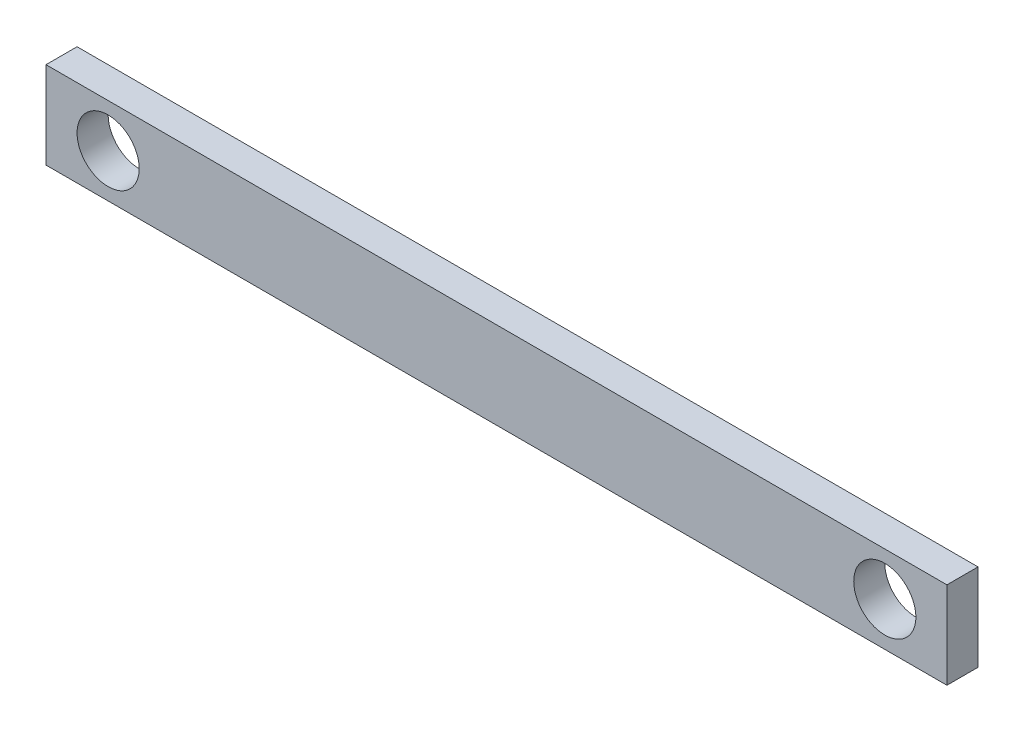
ISO-10303-21;
HEADER;
FILE_DESCRIPTION(('STEP AP214'),'2;1');
FILE_NAME('part.step','',(''),(''),'','','');
FILE_SCHEMA(('AUTOMOTIVE_DESIGN { 1 0 10303 214 1 1 1 1 }'));
ENDSEC;
DATA;
#1=APPLICATION_CONTEXT('core data for automotive mechanical design processes');
#2=APPLICATION_PROTOCOL_DEFINITION('international standard','automotive_design',2000,#1);
#3=PRODUCT_CONTEXT('',#1,'mechanical');
#4=PRODUCT('Part','Part','',(#3));
#5=PRODUCT_RELATED_PRODUCT_CATEGORY('part','',(#4));
#6=PRODUCT_DEFINITION_FORMATION('','',#4);
#7=PRODUCT_DEFINITION_CONTEXT('part definition',#1,'design');
#8=PRODUCT_DEFINITION('design','',#6,#7);
#9=PRODUCT_DEFINITION_SHAPE('','',#8);
#10=(LENGTH_UNIT() NAMED_UNIT(*) SI_UNIT(.MILLI.,.METRE.));
#11=(NAMED_UNIT(*) PLANE_ANGLE_UNIT() SI_UNIT($,.RADIAN.));
#12=(NAMED_UNIT(*) SI_UNIT($,.STERADIAN.) SOLID_ANGLE_UNIT());
#13=UNCERTAINTY_MEASURE_WITH_UNIT(LENGTH_MEASURE(1.E-05),#10,'distance_accuracy_value','');
#14=(GEOMETRIC_REPRESENTATION_CONTEXT(3) GLOBAL_UNCERTAINTY_ASSIGNED_CONTEXT((#13)) GLOBAL_UNIT_ASSIGNED_CONTEXT((#10,
#11,#12)) REPRESENTATION_CONTEXT('',''));
#15=CARTESIAN_POINT('',(0.,0.,0.));
#16=DIRECTION('',(0.,0.,1.));
#17=DIRECTION('',(1.,0.,0.));
#18=AXIS2_PLACEMENT_3D('',#15,#16,#17);
#19=CARTESIAN_POINT('',(0.,0.,-60.));
#20=DIRECTION('',(0.,0.,-1.));
#21=DIRECTION('',(-1.,0.,0.));
#22=AXIS2_PLACEMENT_3D('',#19,#20,#21);
#23=PLANE('',#22);
#24=CARTESIAN_POINT('',(3930.,70.,-60.));
#25=DIRECTION('',(0.,0.,-1.));
#26=DIRECTION('',(-1.,0.,0.));
#27=AXIS2_PLACEMENT_3D('',#24,#25,#26);
#28=CIRCLE('',#27,50.);
#29=CARTESIAN_POINT('',(3880.,70.,-60.));
#30=VERTEX_POINT('',#29);
#31=EDGE_CURVE('E105',#30,#30,#28,.T.);
#32=ORIENTED_EDGE('',*,*,#31,.F.);
#33=EDGE_LOOP('',(#32));
#34=FACE_BOUND('',#33,.T.);
#35=DIRECTION('',(1.,0.,0.));
#36=VECTOR('',#35,1.);
#37=CARTESIAN_POINT('',(2580.,140.,-60.));
#38=LINE('',#37,#36);
#39=CARTESIAN_POINT('',(2580.,140.,-60.));
#40=VERTEX_POINT('',#39);
#41=CARTESIAN_POINT('',(4030.,140.,-60.));
#42=VERTEX_POINT('',#41);
#43=EDGE_CURVE('E90',#40,#42,#38,.T.);
#44=ORIENTED_EDGE('',*,*,#43,.T.);
#45=DIRECTION('',(0.,-1.,0.));
#46=VECTOR('',#45,1.);
#47=CARTESIAN_POINT('',(4030.,140.,-60.));
#48=LINE('',#47,#46);
#49=CARTESIAN_POINT('',(4030.,0.,-60.));
#50=VERTEX_POINT('',#49);
#51=EDGE_CURVE('E85',#42,#50,#48,.T.);
#52=ORIENTED_EDGE('',*,*,#51,.T.);
#53=DIRECTION('',(-1.,0.,0.));
#54=VECTOR('',#53,1.);
#55=CARTESIAN_POINT('',(4030.,0.,-60.));
#56=LINE('',#55,#54);
#57=CARTESIAN_POINT('',(2580.,0.,-60.));
#58=VERTEX_POINT('',#57);
#59=EDGE_CURVE('E88',#50,#58,#56,.T.);
#60=ORIENTED_EDGE('',*,*,#59,.T.);
#61=DIRECTION('',(0.,1.,0.));
#62=VECTOR('',#61,1.);
#63=CARTESIAN_POINT('',(2580.,0.,-60.));
#64=LINE('',#63,#62);
#65=EDGE_CURVE('E55',#58,#40,#64,.T.);
#66=ORIENTED_EDGE('',*,*,#65,.T.);
#67=EDGE_LOOP('',(#44,#52,#60,#66));
#68=FACE_BOUND('',#67,.T.);
#69=CARTESIAN_POINT('',(2680.,70.,-60.));
#70=DIRECTION('',(0.,0.,-1.));
#71=DIRECTION('',(-1.,0.,0.));
#72=AXIS2_PLACEMENT_3D('',#69,#70,#71);
#73=CIRCLE('',#72,50.);
#74=CARTESIAN_POINT('',(2630.,70.,-60.));
#75=VERTEX_POINT('',#74);
#76=EDGE_CURVE('E120',#75,#75,#73,.T.);
#77=ORIENTED_EDGE('',*,*,#76,.F.);
#78=EDGE_LOOP('',(#77));
#79=FACE_BOUND('',#78,.T.);
#80=ADVANCED_FACE('F38',(#34,#68,#79),#23,.T.);
#81=CARTESIAN_POINT('',(0.,0.,-10.));
#82=DIRECTION('',(0.,0.,-1.));
#83=DIRECTION('',(-1.,0.,0.));
#84=AXIS2_PLACEMENT_3D('',#81,#82,#83);
#85=PLANE('',#84);
#86=DIRECTION('',(1.,0.,0.));
#87=VECTOR('',#86,1.);
#88=CARTESIAN_POINT('',(2580.,140.,-10.));
#89=LINE('',#88,#87);
#90=CARTESIAN_POINT('',(2580.,140.,-10.));
#91=VERTEX_POINT('',#90);
#92=CARTESIAN_POINT('',(4030.,140.,-10.));
#93=VERTEX_POINT('',#92);
#94=EDGE_CURVE('E102',#91,#93,#89,.T.);
#95=ORIENTED_EDGE('',*,*,#94,.F.);
#96=DIRECTION('',(0.,1.,0.));
#97=VECTOR('',#96,1.);
#98=CARTESIAN_POINT('',(2580.,0.,-10.));
#99=LINE('',#98,#97);
#100=CARTESIAN_POINT('',(2580.,0.,-10.));
#101=VERTEX_POINT('',#100);
#102=EDGE_CURVE('E78',#101,#91,#99,.T.);
#103=ORIENTED_EDGE('',*,*,#102,.F.);
#104=DIRECTION('',(-1.,0.,0.));
#105=VECTOR('',#104,1.);
#106=CARTESIAN_POINT('',(4030.,0.,-10.));
#107=LINE('',#106,#105);
#108=CARTESIAN_POINT('',(4030.,0.,-10.));
#109=VERTEX_POINT('',#108);
#110=EDGE_CURVE('E72',#109,#101,#107,.T.);
#111=ORIENTED_EDGE('',*,*,#110,.F.);
#112=DIRECTION('',(0.,-1.,0.));
#113=VECTOR('',#112,1.);
#114=CARTESIAN_POINT('',(4030.,140.,-10.));
#115=LINE('',#114,#113);
#116=EDGE_CURVE('E94',#93,#109,#115,.T.);
#117=ORIENTED_EDGE('',*,*,#116,.F.);
#118=EDGE_LOOP('',(#95,#103,#111,#117));
#119=FACE_BOUND('',#118,.T.);
#120=CARTESIAN_POINT('',(3930.,70.,-10.));
#121=DIRECTION('',(0.,0.,-1.));
#122=DIRECTION('',(-1.,0.,0.));
#123=AXIS2_PLACEMENT_3D('',#120,#121,#122);
#124=CIRCLE('',#123,50.);
#125=CARTESIAN_POINT('',(3880.,70.,-10.));
#126=VERTEX_POINT('',#125);
#127=EDGE_CURVE('E117',#126,#126,#124,.T.);
#128=ORIENTED_EDGE('',*,*,#127,.T.);
#129=EDGE_LOOP('',(#128));
#130=FACE_BOUND('',#129,.T.);
#131=CARTESIAN_POINT('',(2680.,70.,-10.));
#132=DIRECTION('',(0.,0.,-1.));
#133=DIRECTION('',(-1.,0.,0.));
#134=AXIS2_PLACEMENT_3D('',#131,#132,#133);
#135=CIRCLE('',#134,50.);
#136=CARTESIAN_POINT('',(2630.,70.,-10.));
#137=VERTEX_POINT('',#136);
#138=EDGE_CURVE('E123',#137,#137,#135,.T.);
#139=ORIENTED_EDGE('',*,*,#138,.T.);
#140=EDGE_LOOP('',(#139));
#141=FACE_BOUND('',#140,.T.);
#142=ADVANCED_FACE('F113',(#119,#130,#141),#85,.F.);
#143=CARTESIAN_POINT('',(2580.,140.,-60.));
#144=DIRECTION('',(0.,-1.,0.));
#145=DIRECTION('',(0.,0.,-1.));
#146=AXIS2_PLACEMENT_3D('',#143,#144,#145);
#147=PLANE('',#146);
#148=ORIENTED_EDGE('',*,*,#94,.T.);
#149=DIRECTION('',(0.,0.,1.));
#150=VECTOR('',#149,1.);
#151=CARTESIAN_POINT('',(4030.,140.,-60.));
#152=LINE('',#151,#150);
#153=EDGE_CURVE('E11',#42,#93,#152,.T.);
#154=ORIENTED_EDGE('',*,*,#153,.F.);
#155=ORIENTED_EDGE('',*,*,#43,.F.);
#156=DIRECTION('',(0.,0.,1.));
#157=VECTOR('',#156,1.);
#158=CARTESIAN_POINT('',(2580.,140.,-60.));
#159=LINE('',#158,#157);
#160=EDGE_CURVE('E98',#40,#91,#159,.T.);
#161=ORIENTED_EDGE('',*,*,#160,.T.);
#162=EDGE_LOOP('',(#148,#154,#155,#161));
#163=FACE_BOUND('',#162,.T.);
#164=ADVANCED_FACE('F40',(#163),#147,.F.);
#165=CARTESIAN_POINT('',(4030.,140.,-60.));
#166=DIRECTION('',(-1.,0.,0.));
#167=DIRECTION('',(0.,0.,1.));
#168=AXIS2_PLACEMENT_3D('',#165,#166,#167);
#169=PLANE('',#168);
#170=ORIENTED_EDGE('',*,*,#116,.T.);
#171=DIRECTION('',(0.,0.,1.));
#172=VECTOR('',#171,1.);
#173=CARTESIAN_POINT('',(4030.,0.,-60.));
#174=LINE('',#173,#172);
#175=EDGE_CURVE('E47',#50,#109,#174,.T.);
#176=ORIENTED_EDGE('',*,*,#175,.F.);
#177=ORIENTED_EDGE('',*,*,#51,.F.);
#178=ORIENTED_EDGE('',*,*,#153,.T.);
#179=EDGE_LOOP('',(#170,#176,#177,#178));
#180=FACE_BOUND('',#179,.T.);
#181=ADVANCED_FACE('F93',(#180),#169,.F.);
#182=CARTESIAN_POINT('',(4030.,0.,-60.));
#183=DIRECTION('',(0.,1.,0.));
#184=DIRECTION('',(0.,0.,1.));
#185=AXIS2_PLACEMENT_3D('',#182,#183,#184);
#186=PLANE('',#185);
#187=ORIENTED_EDGE('',*,*,#110,.T.);
#188=DIRECTION('',(0.,0.,1.));
#189=VECTOR('',#188,1.);
#190=CARTESIAN_POINT('',(2580.,0.,-60.));
#191=LINE('',#190,#189);
#192=EDGE_CURVE('E95',#58,#101,#191,.T.);
#193=ORIENTED_EDGE('',*,*,#192,.F.);
#194=ORIENTED_EDGE('',*,*,#59,.F.);
#195=ORIENTED_EDGE('',*,*,#175,.T.);
#196=EDGE_LOOP('',(#187,#193,#194,#195));
#197=FACE_BOUND('',#196,.T.);
#198=ADVANCED_FACE('F96',(#197),#186,.F.);
#199=CARTESIAN_POINT('',(2580.,0.,-60.));
#200=DIRECTION('',(1.,0.,0.));
#201=DIRECTION('',(0.,0.,-1.));
#202=AXIS2_PLACEMENT_3D('',#199,#200,#201);
#203=PLANE('',#202);
#204=ORIENTED_EDGE('',*,*,#102,.T.);
#205=ORIENTED_EDGE('',*,*,#160,.F.);
#206=ORIENTED_EDGE('',*,*,#65,.F.);
#207=ORIENTED_EDGE('',*,*,#192,.T.);
#208=EDGE_LOOP('',(#204,#205,#206,#207));
#209=FACE_BOUND('',#208,.T.);
#210=ADVANCED_FACE('F110',(#209),#203,.F.);
#211=CARTESIAN_POINT('',(3930.,70.,-60.));
#212=DIRECTION('',(0.,0.,1.));
#213=DIRECTION('',(1.,0.,0.));
#214=AXIS2_PLACEMENT_3D('',#211,#212,#213);
#215=CYLINDRICAL_SURFACE('',#214,50.);
#216=ORIENTED_EDGE('',*,*,#31,.T.);
#217=EDGE_LOOP('',(#216));
#218=FACE_BOUND('',#217,.T.);
#219=ORIENTED_EDGE('',*,*,#127,.F.);
#220=EDGE_LOOP('',(#219));
#221=FACE_BOUND('',#220,.T.);
#222=ADVANCED_FACE('F140',(#218,#221),#215,.F.);
#223=CARTESIAN_POINT('',(2680.,70.,-60.));
#224=DIRECTION('',(0.,0.,1.));
#225=DIRECTION('',(1.,0.,0.));
#226=AXIS2_PLACEMENT_3D('',#223,#224,#225);
#227=CYLINDRICAL_SURFACE('',#226,50.);
#228=ORIENTED_EDGE('',*,*,#76,.T.);
#229=EDGE_LOOP('',(#228));
#230=FACE_BOUND('',#229,.T.);
#231=ORIENTED_EDGE('',*,*,#138,.F.);
#232=EDGE_LOOP('',(#231));
#233=FACE_BOUND('',#232,.T.);
#234=ADVANCED_FACE('F129',(#230,#233),#227,.F.);
#235=CLOSED_SHELL('',(#80,#142,#164,#181,#198,#210,#222,#234));
#236=MANIFOLD_SOLID_BREP('B2',#235);
#237=ADVANCED_BREP_SHAPE_REPRESENTATION('',(#18,#236),#14);
#238=SHAPE_DEFINITION_REPRESENTATION(#9,#237);
ENDSEC;
END-ISO-10303-21;
